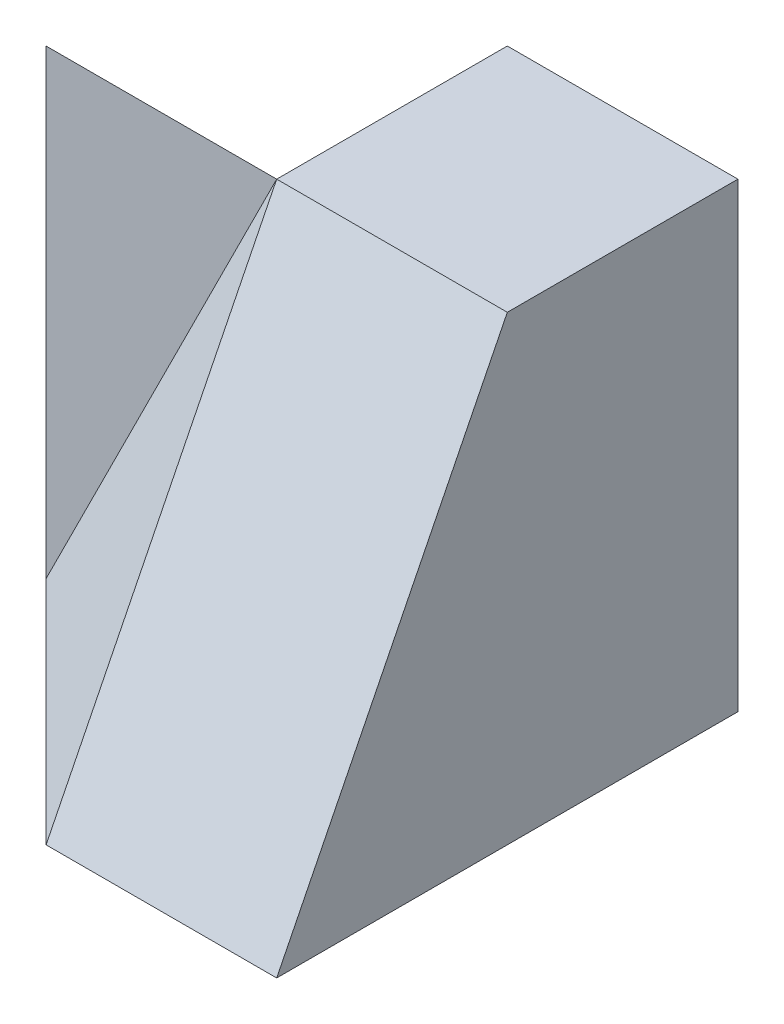
ISO-10303-21;
HEADER;
FILE_DESCRIPTION(('STEP AP214'),'2;1');
FILE_NAME('part.step','',(''),(''),'','','');
FILE_SCHEMA(('AUTOMOTIVE_DESIGN { 1 0 10303 214 1 1 1 1 }'));
ENDSEC;
DATA;
#1=APPLICATION_CONTEXT('core data for automotive mechanical design processes');
#2=APPLICATION_PROTOCOL_DEFINITION('international standard','automotive_design',2000,#1);
#3=PRODUCT_CONTEXT('',#1,'mechanical');
#4=PRODUCT('Part','Part','',(#3));
#5=PRODUCT_RELATED_PRODUCT_CATEGORY('part','',(#4));
#6=PRODUCT_DEFINITION_FORMATION('','',#4);
#7=PRODUCT_DEFINITION_CONTEXT('part definition',#1,'design');
#8=PRODUCT_DEFINITION('design','',#6,#7);
#9=PRODUCT_DEFINITION_SHAPE('','',#8);
#10=(LENGTH_UNIT() NAMED_UNIT(*) SI_UNIT(.MILLI.,.METRE.));
#11=(NAMED_UNIT(*) PLANE_ANGLE_UNIT() SI_UNIT($,.RADIAN.));
#12=(NAMED_UNIT(*) SI_UNIT($,.STERADIAN.) SOLID_ANGLE_UNIT());
#13=UNCERTAINTY_MEASURE_WITH_UNIT(LENGTH_MEASURE(1.E-05),#10,'distance_accuracy_value','');
#14=(GEOMETRIC_REPRESENTATION_CONTEXT(3) GLOBAL_UNCERTAINTY_ASSIGNED_CONTEXT((#13)) GLOBAL_UNIT_ASSIGNED_CONTEXT((#10,
#11,#12)) REPRESENTATION_CONTEXT('',''));
#15=CARTESIAN_POINT('',(0.,0.,0.));
#16=DIRECTION('',(0.,0.,1.));
#17=DIRECTION('',(1.,0.,0.));
#18=AXIS2_PLACEMENT_3D('',#15,#16,#17);
#19=CARTESIAN_POINT('',(40.,0.,40.));
#20=DIRECTION('',(0.,-0.447213595499958,-0.894427190999916));
#21=DIRECTION('',(0.,0.894427190999916,-0.447213595499958));
#22=AXIS2_PLACEMENT_3D('',#19,#20,#21);
#23=PLANE('',#22);
#24=DIRECTION('',(0.,0.894427190999916,-0.447213595499958));
#25=VECTOR('',#24,1.);
#26=CARTESIAN_POINT('',(20.,40.,20.));
#27=LINE('',#26,#25);
#28=CARTESIAN_POINT('',(20.,0.,40.));
#29=VERTEX_POINT('',#28);
#30=CARTESIAN_POINT('',(20.,40.,20.));
#31=VERTEX_POINT('',#30);
#32=EDGE_CURVE('E109',#29,#31,#27,.T.);
#33=ORIENTED_EDGE('',*,*,#32,.F.);
#34=DIRECTION('',(1.,0.,0.));
#35=VECTOR('',#34,1.);
#36=CARTESIAN_POINT('',(0.,0.,40.));
#37=LINE('',#36,#35);
#38=CARTESIAN_POINT('',(40.,0.,40.));
#39=VERTEX_POINT('',#38);
#40=EDGE_CURVE('E123',#29,#39,#37,.T.);
#41=ORIENTED_EDGE('',*,*,#40,.T.);
#42=DIRECTION('',(0.,-0.894427190999916,0.447213595499958));
#43=VECTOR('',#42,1.);
#44=CARTESIAN_POINT('',(40.,0.,40.));
#45=LINE('',#44,#43);
#46=CARTESIAN_POINT('',(40.,40.,20.));
#47=VERTEX_POINT('',#46);
#48=EDGE_CURVE('E112',#47,#39,#45,.T.);
#49=ORIENTED_EDGE('',*,*,#48,.F.);
#50=DIRECTION('',(-1.,0.,0.));
#51=VECTOR('',#50,1.);
#52=CARTESIAN_POINT('',(40.,40.,20.));
#53=LINE('',#52,#51);
#54=EDGE_CURVE('E115',#47,#31,#53,.T.);
#55=ORIENTED_EDGE('',*,*,#54,.T.);
#56=EDGE_LOOP('',(#33,#41,#49,#55));
#57=FACE_BOUND('',#56,.T.);
#58=ADVANCED_FACE('F33',(#57),#23,.F.);
#59=CARTESIAN_POINT('',(0.,40.,40.));
#60=DIRECTION('',(0.,-1.,0.));
#61=DIRECTION('',(0.,0.,-1.));
#62=AXIS2_PLACEMENT_3D('',#59,#60,#61);
#63=PLANE('',#62);
#64=DIRECTION('',(0.,0.,-1.));
#65=VECTOR('',#64,1.);
#66=CARTESIAN_POINT('',(20.,40.,0.));
#67=LINE('',#66,#65);
#68=CARTESIAN_POINT('',(20.,40.,0.));
#69=VERTEX_POINT('',#68);
#70=EDGE_CURVE('E108',#31,#69,#67,.T.);
#71=ORIENTED_EDGE('',*,*,#70,.F.);
#72=ORIENTED_EDGE('',*,*,#54,.F.);
#73=DIRECTION('',(0.,0.,-1.));
#74=VECTOR('',#73,1.);
#75=CARTESIAN_POINT('',(40.,40.,40.));
#76=LINE('',#75,#74);
#77=CARTESIAN_POINT('',(40.,40.,0.));
#78=VERTEX_POINT('',#77);
#79=EDGE_CURVE('E48',#47,#78,#76,.T.);
#80=ORIENTED_EDGE('',*,*,#79,.T.);
#81=DIRECTION('',(-1.,0.,0.));
#82=VECTOR('',#81,1.);
#83=CARTESIAN_POINT('',(0.,40.,0.));
#84=LINE('',#83,#82);
#85=EDGE_CURVE('E125',#78,#69,#84,.T.);
#86=ORIENTED_EDGE('',*,*,#85,.T.);
#87=EDGE_LOOP('',(#71,#72,#80,#86));
#88=FACE_BOUND('',#87,.T.);
#89=ADVANCED_FACE('F141',(#88),#63,.F.);
#90=CARTESIAN_POINT('',(0.,0.,40.));
#91=DIRECTION('',(1.,0.,0.));
#92=DIRECTION('',(0.,0.,-1.));
#93=AXIS2_PLACEMENT_3D('',#90,#91,#92);
#94=PLANE('',#93);
#95=DIRECTION('',(0.,-1.,0.));
#96=VECTOR('',#95,1.);
#97=CARTESIAN_POINT('',(0.,40.,20.));
#98=LINE('',#97,#96);
#99=CARTESIAN_POINT('',(0.,40.,20.));
#100=VERTEX_POINT('',#99);
#101=CARTESIAN_POINT('',(0.,0.,20.));
#102=VERTEX_POINT('',#101);
#103=EDGE_CURVE('E92',#100,#102,#98,.T.);
#104=ORIENTED_EDGE('',*,*,#103,.F.);
#105=DIRECTION('',(0.,0.707106781186548,0.707106781186548));
#106=VECTOR('',#105,1.);
#107=CARTESIAN_POINT('',(0.,40.,20.));
#108=LINE('',#107,#106);
#109=CARTESIAN_POINT('',(0.,20.,0.));
#110=VERTEX_POINT('',#109);
#111=EDGE_CURVE('E103',#110,#100,#108,.T.);
#112=ORIENTED_EDGE('',*,*,#111,.F.);
#113=DIRECTION('',(0.,-1.,0.));
#114=VECTOR('',#113,1.);
#115=CARTESIAN_POINT('',(0.,0.,0.));
#116=LINE('',#115,#114);
#117=CARTESIAN_POINT('',(0.,0.,0.));
#118=VERTEX_POINT('',#117);
#119=EDGE_CURVE('E122',#110,#118,#116,.T.);
#120=ORIENTED_EDGE('',*,*,#119,.T.);
#121=DIRECTION('',(0.,0.,-1.));
#122=VECTOR('',#121,1.);
#123=CARTESIAN_POINT('',(0.,0.,40.));
#124=LINE('',#123,#122);
#125=EDGE_CURVE('E11',#102,#118,#124,.T.);
#126=ORIENTED_EDGE('',*,*,#125,.F.);
#127=EDGE_LOOP('',(#104,#112,#120,#126));
#128=FACE_BOUND('',#127,.T.);
#129=ADVANCED_FACE('F35',(#128),#94,.F.);
#130=CARTESIAN_POINT('',(0.,0.,40.));
#131=DIRECTION('',(0.,1.,0.));
#132=DIRECTION('',(0.,0.,1.));
#133=AXIS2_PLACEMENT_3D('',#130,#131,#132);
#134=PLANE('',#133);
#135=ORIENTED_EDGE('',*,*,#40,.F.);
#136=DIRECTION('',(0.707106781186548,0.,0.707106781186548));
#137=VECTOR('',#136,1.);
#138=CARTESIAN_POINT('',(0.,0.,20.));
#139=LINE('',#138,#137);
#140=EDGE_CURVE('E99',#102,#29,#139,.T.);
#141=ORIENTED_EDGE('',*,*,#140,.F.);
#142=ORIENTED_EDGE('',*,*,#125,.T.);
#143=DIRECTION('',(1.,0.,0.));
#144=VECTOR('',#143,1.);
#145=CARTESIAN_POINT('',(0.,0.,0.));
#146=LINE('',#145,#144);
#147=CARTESIAN_POINT('',(40.,0.,0.));
#148=VERTEX_POINT('',#147);
#149=EDGE_CURVE('E55',#118,#148,#146,.T.);
#150=ORIENTED_EDGE('',*,*,#149,.T.);
#151=DIRECTION('',(0.,0.,-1.));
#152=VECTOR('',#151,1.);
#153=CARTESIAN_POINT('',(40.,0.,40.));
#154=LINE('',#153,#152);
#155=EDGE_CURVE('E41',#39,#148,#154,.T.);
#156=ORIENTED_EDGE('',*,*,#155,.F.);
#157=EDGE_LOOP('',(#135,#141,#142,#150,#156));
#158=FACE_BOUND('',#157,.T.);
#159=ADVANCED_FACE('F147',(#158),#134,.F.);
#160=CARTESIAN_POINT('',(40.,0.,40.));
#161=DIRECTION('',(-1.,0.,0.));
#162=DIRECTION('',(0.,0.,1.));
#163=AXIS2_PLACEMENT_3D('',#160,#161,#162);
#164=PLANE('',#163);
#165=ORIENTED_EDGE('',*,*,#79,.F.);
#166=ORIENTED_EDGE('',*,*,#48,.T.);
#167=ORIENTED_EDGE('',*,*,#155,.T.);
#168=DIRECTION('',(0.,1.,0.));
#169=VECTOR('',#168,1.);
#170=CARTESIAN_POINT('',(40.,0.,0.));
#171=LINE('',#170,#169);
#172=EDGE_CURVE('E128',#148,#78,#171,.T.);
#173=ORIENTED_EDGE('',*,*,#172,.T.);
#174=EDGE_LOOP('',(#165,#166,#167,#173));
#175=FACE_BOUND('',#174,.T.);
#176=ADVANCED_FACE('F133',(#175),#164,.F.);
#177=CARTESIAN_POINT('',(0.,0.,0.));
#178=DIRECTION('',(0.,0.,-1.));
#179=DIRECTION('',(-1.,0.,0.));
#180=AXIS2_PLACEMENT_3D('',#177,#178,#179);
#181=PLANE('',#180);
#182=DIRECTION('',(-1.,0.,0.));
#183=VECTOR('',#182,1.);
#184=CARTESIAN_POINT('',(20.,20.,0.));
#185=LINE('',#184,#183);
#186=CARTESIAN_POINT('',(20.,20.,0.));
#187=VERTEX_POINT('',#186);
#188=EDGE_CURVE('E100',#187,#110,#185,.T.);
#189=ORIENTED_EDGE('',*,*,#188,.F.);
#190=DIRECTION('',(0.,-1.,0.));
#191=VECTOR('',#190,1.);
#192=CARTESIAN_POINT('',(20.,20.,0.));
#193=LINE('',#192,#191);
#194=EDGE_CURVE('E139',#69,#187,#193,.T.);
#195=ORIENTED_EDGE('',*,*,#194,.F.);
#196=ORIENTED_EDGE('',*,*,#85,.F.);
#197=ORIENTED_EDGE('',*,*,#172,.F.);
#198=ORIENTED_EDGE('',*,*,#149,.F.);
#199=ORIENTED_EDGE('',*,*,#119,.F.);
#200=EDGE_LOOP('',(#189,#195,#196,#197,#198,#199));
#201=FACE_BOUND('',#200,.T.);
#202=ADVANCED_FACE('F137',(#201),#181,.T.);
#203=CARTESIAN_POINT('',(20.,40.,20.));
#204=DIRECTION('',(0.,-0.707106781186548,0.707106781186548));
#205=DIRECTION('',(0.,-0.707106781186548,-0.707106781186548));
#206=AXIS2_PLACEMENT_3D('',#203,#204,#205);
#207=PLANE('',#206);
#208=ORIENTED_EDGE('',*,*,#111,.T.);
#209=DIRECTION('',(-1.,0.,0.));
#210=VECTOR('',#209,1.);
#211=CARTESIAN_POINT('',(20.,40.,20.));
#212=LINE('',#211,#210);
#213=EDGE_CURVE('E88',#31,#100,#212,.T.);
#214=ORIENTED_EDGE('',*,*,#213,.F.);
#215=DIRECTION('',(0.,0.707106781186548,0.707106781186548));
#216=VECTOR('',#215,1.);
#217=CARTESIAN_POINT('',(20.,40.,20.));
#218=LINE('',#217,#216);
#219=EDGE_CURVE('E154',#187,#31,#218,.T.);
#220=ORIENTED_EDGE('',*,*,#219,.F.);
#221=ORIENTED_EDGE('',*,*,#188,.T.);
#222=EDGE_LOOP('',(#208,#214,#220,#221));
#223=FACE_BOUND('',#222,.T.);
#224=ADVANCED_FACE('F104',(#223),#207,.F.);
#225=CARTESIAN_POINT('',(20.,0.,0.));
#226=DIRECTION('',(-1.,0.,0.));
#227=DIRECTION('',(0.,0.,1.));
#228=AXIS2_PLACEMENT_3D('',#225,#226,#227);
#229=PLANE('',#228);
#230=ORIENTED_EDGE('',*,*,#70,.T.);
#231=ORIENTED_EDGE('',*,*,#194,.T.);
#232=ORIENTED_EDGE('',*,*,#219,.T.);
#233=EDGE_LOOP('',(#230,#231,#232));
#234=FACE_BOUND('',#233,.T.);
#235=ADVANCED_FACE('F155',(#234),#229,.T.);
#236=CARTESIAN_POINT('',(-8.8888888888889,4.44444444444445,8.88888888888889));
#237=DIRECTION('',(-0.666666666666667,0.333333333333333,0.666666666666667));
#238=DIRECTION('',(0.707106781186547,0.,0.707106781186548));
#239=AXIS2_PLACEMENT_3D('',#236,#237,#238);
#240=PLANE('',#239);
#241=DIRECTION('',(-0.447213595499958,-0.894427190999916,0.));
#242=VECTOR('',#241,1.);
#243=CARTESIAN_POINT('',(0.,0.,20.));
#244=LINE('',#243,#242);
#245=EDGE_CURVE('E94',#31,#102,#244,.T.);
#246=ORIENTED_EDGE('',*,*,#245,.T.);
#247=ORIENTED_EDGE('',*,*,#140,.T.);
#248=ORIENTED_EDGE('',*,*,#32,.T.);
#249=EDGE_LOOP('',(#246,#247,#248));
#250=FACE_BOUND('',#249,.T.);
#251=ADVANCED_FACE('F149',(#250),#240,.T.);
#252=CARTESIAN_POINT('',(0.,0.,20.));
#253=DIRECTION('',(0.,0.,1.));
#254=DIRECTION('',(1.,0.,0.));
#255=AXIS2_PLACEMENT_3D('',#252,#253,#254);
#256=PLANE('',#255);
#257=ORIENTED_EDGE('',*,*,#213,.T.);
#258=ORIENTED_EDGE('',*,*,#103,.T.);
#259=ORIENTED_EDGE('',*,*,#245,.F.);
#260=EDGE_LOOP('',(#257,#258,#259));
#261=FACE_BOUND('',#260,.T.);
#262=ADVANCED_FACE('F90',(#261),#256,.T.);
#263=CLOSED_SHELL('',(#58,#89,#129,#159,#176,#202,#224,#235,#251,#262));
#264=MANIFOLD_SOLID_BREP('B2',#263);
#265=ADVANCED_BREP_SHAPE_REPRESENTATION('',(#18,#264),#14);
#266=SHAPE_DEFINITION_REPRESENTATION(#9,#265);
ENDSEC;
END-ISO-10303-21;
